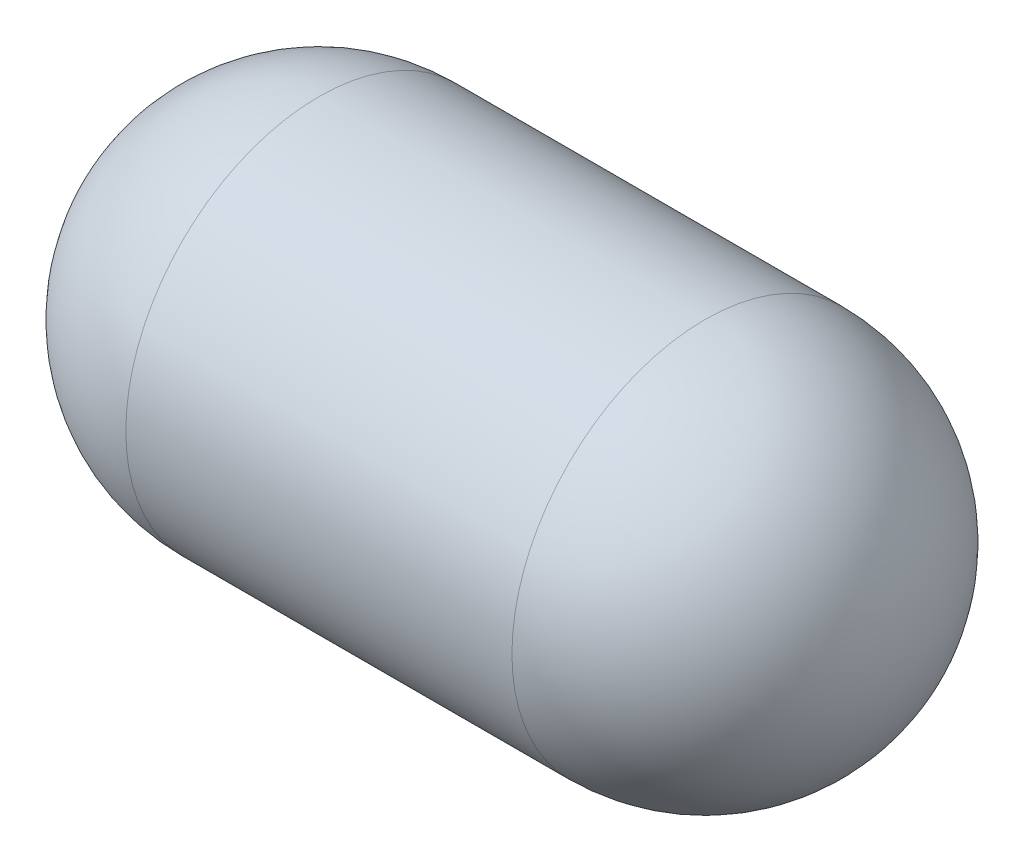
ISO-10303-21;
HEADER;
FILE_DESCRIPTION(('STEP AP214'),'2;1');
FILE_NAME('part.step','',(''),(''),'','','');
FILE_SCHEMA(('AUTOMOTIVE_DESIGN { 1 0 10303 214 1 1 1 1 }'));
ENDSEC;
DATA;
#1=APPLICATION_CONTEXT('core data for automotive mechanical design processes');
#2=APPLICATION_PROTOCOL_DEFINITION('international standard','automotive_design',2000,#1);
#3=PRODUCT_CONTEXT('',#1,'mechanical');
#4=PRODUCT('Part','Part','',(#3));
#5=PRODUCT_RELATED_PRODUCT_CATEGORY('part','',(#4));
#6=PRODUCT_DEFINITION_FORMATION('','',#4);
#7=PRODUCT_DEFINITION_CONTEXT('part definition',#1,'design');
#8=PRODUCT_DEFINITION('design','',#6,#7);
#9=PRODUCT_DEFINITION_SHAPE('','',#8);
#10=(LENGTH_UNIT() NAMED_UNIT(*) SI_UNIT(.MILLI.,.METRE.));
#11=(NAMED_UNIT(*) PLANE_ANGLE_UNIT() SI_UNIT($,.RADIAN.));
#12=(NAMED_UNIT(*) SI_UNIT($,.STERADIAN.) SOLID_ANGLE_UNIT());
#13=UNCERTAINTY_MEASURE_WITH_UNIT(LENGTH_MEASURE(1.E-05),#10,'distance_accuracy_value','');
#14=(GEOMETRIC_REPRESENTATION_CONTEXT(3) GLOBAL_UNCERTAINTY_ASSIGNED_CONTEXT((#13)) GLOBAL_UNIT_ASSIGNED_CONTEXT((#10,
#11,#12)) REPRESENTATION_CONTEXT('',''));
#15=CARTESIAN_POINT('',(0.,0.,0.));
#16=DIRECTION('',(0.,0.,1.));
#17=DIRECTION('',(1.,0.,0.));
#18=AXIS2_PLACEMENT_3D('',#15,#16,#17);
#19=CARTESIAN_POINT('',(12.7,0.,0.));
#20=DIRECTION('',(-1.,0.,0.));
#21=DIRECTION('',(0.,0.,1.));
#22=AXIS2_PLACEMENT_3D('',#19,#20,#21);
#23=CYLINDRICAL_SURFACE('',#22,3.175);
#24=CARTESIAN_POINT('',(3.175,0.,0.));
#25=DIRECTION('',(-1.,0.,0.));
#26=DIRECTION('',(0.,0.,1.));
#27=AXIS2_PLACEMENT_3D('',#24,#25,#26);
#28=CIRCLE('',#27,3.175);
#29=CARTESIAN_POINT('',(3.175,0.,3.175));
#30=VERTEX_POINT('',#29);
#31=EDGE_CURVE('E10',#30,#30,#28,.F.);
#32=ORIENTED_EDGE('',*,*,#31,.T.);
#33=EDGE_LOOP('',(#32));
#34=FACE_BOUND('',#33,.T.);
#35=CARTESIAN_POINT('',(9.525,0.,0.));
#36=DIRECTION('',(-1.,0.,0.));
#37=DIRECTION('',(0.,0.,1.));
#38=AXIS2_PLACEMENT_3D('',#35,#36,#37);
#39=CIRCLE('',#38,3.175);
#40=CARTESIAN_POINT('',(9.525,0.,3.175));
#41=VERTEX_POINT('',#40);
#42=EDGE_CURVE('E44',#41,#41,#39,.T.);
#43=ORIENTED_EDGE('',*,*,#42,.T.);
#44=EDGE_LOOP('',(#43));
#45=FACE_BOUND('',#44,.T.);
#46=ADVANCED_FACE('F36',(#34,#45),#23,.T.);
#47=CARTESIAN_POINT('',(3.175,0.,0.));
#48=DIRECTION('',(1.,0.,0.));
#49=DIRECTION('',(0.,0.,-1.));
#50=AXIS2_PLACEMENT_3D('',#47,#48,#49);
#51=SPHERICAL_SURFACE('',#50,3.175);
#52=ORIENTED_EDGE('',*,*,#31,.F.);
#53=EDGE_LOOP('',(#52));
#54=FACE_BOUND('',#53,.T.);
#55=ADVANCED_FACE('F53',(#54),#51,.T.);
#56=CARTESIAN_POINT('',(9.525,0.,0.));
#57=DIRECTION('',(1.,0.,0.));
#58=DIRECTION('',(0.,0.,-1.));
#59=AXIS2_PLACEMENT_3D('',#56,#57,#58);
#60=SPHERICAL_SURFACE('',#59,3.175);
#61=ORIENTED_EDGE('',*,*,#42,.F.);
#62=EDGE_LOOP('',(#61));
#63=FACE_BOUND('',#62,.T.);
#64=ADVANCED_FACE('F38',(#63),#60,.T.);
#65=CLOSED_SHELL('',(#46,#55,#64));
#66=MANIFOLD_SOLID_BREP('B2',#65);
#67=ADVANCED_BREP_SHAPE_REPRESENTATION('',(#18,#66),#14);
#68=SHAPE_DEFINITION_REPRESENTATION(#9,#67);
ENDSEC;
END-ISO-10303-21;
